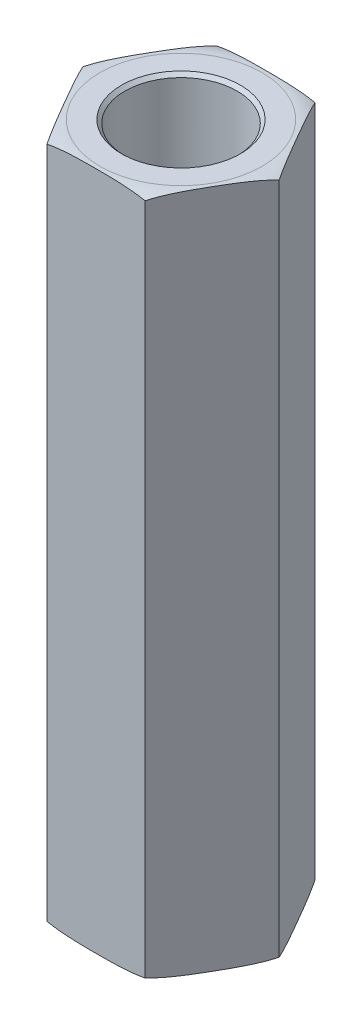
ISO-10303-21;
HEADER;
FILE_DESCRIPTION(('STEP AP214'),'2;1');
FILE_NAME('part.step','',(''),(''),'','','');
FILE_SCHEMA(('AUTOMOTIVE_DESIGN { 1 0 10303 214 1 1 1 1 }'));
ENDSEC;
DATA;
#1=APPLICATION_CONTEXT('core data for automotive mechanical design processes');
#2=APPLICATION_PROTOCOL_DEFINITION('international standard','automotive_design',2000,#1);
#3=PRODUCT_CONTEXT('',#1,'mechanical');
#4=PRODUCT('Part','Part','',(#3));
#5=PRODUCT_RELATED_PRODUCT_CATEGORY('part','',(#4));
#6=PRODUCT_DEFINITION_FORMATION('','',#4);
#7=PRODUCT_DEFINITION_CONTEXT('part definition',#1,'design');
#8=PRODUCT_DEFINITION('design','',#6,#7);
#9=PRODUCT_DEFINITION_SHAPE('','',#8);
#10=(LENGTH_UNIT() NAMED_UNIT(*) SI_UNIT(.MILLI.,.METRE.));
#11=(NAMED_UNIT(*) PLANE_ANGLE_UNIT() SI_UNIT($,.RADIAN.));
#12=(NAMED_UNIT(*) SI_UNIT($,.STERADIAN.) SOLID_ANGLE_UNIT());
#13=UNCERTAINTY_MEASURE_WITH_UNIT(LENGTH_MEASURE(1.E-05),#10,'distance_accuracy_value','');
#14=(GEOMETRIC_REPRESENTATION_CONTEXT(3) GLOBAL_UNCERTAINTY_ASSIGNED_CONTEXT((#13)) GLOBAL_UNIT_ASSIGNED_CONTEXT((#10,
#11,#12)) REPRESENTATION_CONTEXT('',''));
#15=CARTESIAN_POINT('',(0.,0.,0.));
#16=DIRECTION('',(0.,0.,1.));
#17=DIRECTION('',(1.,0.,0.));
#18=AXIS2_PLACEMENT_3D('',#15,#16,#17);
#19=CARTESIAN_POINT('',(3.66617420935412,12.7,0.));
#20=DIRECTION('',(-0.866025403784439,0.,0.5));
#21=DIRECTION('',(0.5,0.,0.866025403784439));
#22=AXIS2_PLACEMENT_3D('',#19,#20,#21);
#23=PLANE('',#22);
#24=DIRECTION('',(0.,1.,0.));
#25=VECTOR('',#24,1.);
#26=CARTESIAN_POINT('',(1.83308710467704,12.7,-3.175));
#27=LINE('',#26,#25);
#28=CARTESIAN_POINT('',(1.83308710467705,-12.573,-3.175));
#29=VERTEX_POINT('',#28);
#30=CARTESIAN_POINT('',(1.83308710467706,12.573,-3.175));
#31=VERTEX_POINT('',#30);
#32=EDGE_CURVE('E142',#29,#31,#27,.T.);
#33=ORIENTED_EDGE('',*,*,#32,.T.);
#34=CARTESIAN_POINT('',(3.66617420935412,12.573,0.));
#35=CARTESIAN_POINT('',(3.62797961467394,12.5889014148997,-0.0661549785605585));
#36=CARTESIAN_POINT('',(3.58956810864157,12.6024886076105,-0.132685658603878));
#37=CARTESIAN_POINT('',(3.5124905179571,12.6258161979402,-0.266187961794366));
#38=CARTESIAN_POINT('',(3.47382473049846,12.6355604771397,-0.333159070187399));
#39=CARTESIAN_POINT('',(3.39641631867872,12.6519966530451,-0.467234372392395));
#40=CARTESIAN_POINT('',(3.35767399633311,12.6586945328669,-0.534338043098201));
#41=CARTESIAN_POINT('',(3.28009834620112,12.6697767572932,-0.668703010557003));
#42=CARTESIAN_POINT('',(3.2412649958777,12.674160450474,-0.735964346345292));
#43=CARTESIAN_POINT('',(3.16354065964313,12.6812403004263,-0.870586845688127));
#44=CARTESIAN_POINT('',(3.12464965374474,12.6839355237591,-0.9379480438616));
#45=CARTESIAN_POINT('',(3.04685144594591,12.6881531983713,-1.07269849250698));
#46=CARTESIAN_POINT('',(3.00794424351967,12.6896756080272,-1.14008774388959));
#47=CARTESIAN_POINT('',(2.93051517598871,12.691922705889,-1.2741988228359));
#48=CARTESIAN_POINT('',(2.89199336248932,12.6926552468181,-1.34092056101654));
#49=CARTESIAN_POINT('',(2.8149477834614,12.6935767302574,-1.47436741839144));
#50=CARTESIAN_POINT('',(2.77642401791436,12.6937656658949,-1.5410925376178));
#51=CARTESIAN_POINT('',(2.69935964431009,12.6936659966806,-1.67457194815386));
#52=CARTESIAN_POINT('',(2.66081903631818,12.6933771811766,-1.74132623935045));
#53=CARTESIAN_POINT('',(2.58373908085326,12.692221986219,-1.87483263846084));
#54=CARTESIAN_POINT('',(2.54519973341241,12.6913555970386,-1.94158474631893));
#55=CARTESIAN_POINT('',(2.46812969629766,12.6887861940656,-2.0750739663429));
#56=CARTESIAN_POINT('',(2.42959900625961,12.6870832271617,-2.1418110791395));
#57=CARTESIAN_POINT('',(2.35255651340904,12.6824387229726,-2.27525259109845));
#58=CARTESIAN_POINT('',(2.31404470975438,12.6794972471358,-2.34195699171943));
#59=CARTESIAN_POINT('',(2.2508420623994,12.6732174124749,-2.45142718811111));
#60=CARTESIAN_POINT('',(2.22613849337005,12.6703980110463,-2.49421502479823));
#61=CARTESIAN_POINT('',(2.17676945272224,12.6638696794304,-2.57972471152118));
#62=CARTESIAN_POINT('',(2.1521039703418,12.6601610809139,-2.6224465801973));
#63=CARTESIAN_POINT('',(2.10282753811693,12.6516802711497,-2.7077958644265));
#64=CARTESIAN_POINT('',(2.07821657107526,12.6469084657008,-2.75042330976607));
#65=CARTESIAN_POINT('',(2.02900094683547,12.6360987712516,-2.8356672714756));
#66=CARTESIAN_POINT('',(2.00439646085461,12.6300577313084,-2.87828349128856));
#67=CARTESIAN_POINT('',(1.95527325900932,12.6165138354161,-2.96336737271507));
#68=CARTESIAN_POINT('',(1.93075459617613,12.609010197803,-3.00583494247581));
#69=CARTESIAN_POINT('',(1.8818215737317,12.5923203507084,-3.09058942351746));
#70=CARTESIAN_POINT('',(1.85740744053269,12.5831314978033,-3.13287594264091));
#71=CARTESIAN_POINT('',(1.83308710467706,12.573,-3.175));
#72=B_SPLINE_CURVE_WITH_KNOTS('',3,(#34,#35,#36,#37,#38,#39,#40,#41,#42,#43,#44,#45,#46,#47,#48,
#49,#50,#51,#52,#53,#54,#55,#56,#57,#58,#59,#60,#61,#62,#63,#64,#65,#66,#67,#68,#69,#70,#71),
.UNSPECIFIED.,.F.,.F.,(4,2,2,2,2,2,2,2,2,2,2,2,2,2,2,2,2,2,4),(0.,0.233977307817949,
0.467717675040708,0.700996973557522,0.934341903229779,1.16781571967243,1.40129782179829,
1.63243665809675,1.86357841666623,2.09482211846301,2.32606971471502,2.55730435147406,
2.78852751694422,2.93698369265095,3.0853845800448,3.23372892334589,3.38244598546616,
3.53124274626086,3.68027493713586),.UNSPECIFIED.);
#73=CARTESIAN_POINT('',(3.66617420935412,12.573,0.));
#74=VERTEX_POINT('',#73);
#75=EDGE_CURVE('E96',#74,#31,#72,.T.);
#76=ORIENTED_EDGE('',*,*,#75,.F.);
#77=DIRECTION('',(0.,1.,0.));
#78=VECTOR('',#77,1.);
#79=CARTESIAN_POINT('',(3.66617420935412,12.7,0.));
#80=LINE('',#79,#78);
#81=CARTESIAN_POINT('',(3.66617420935412,-12.573,0.));
#82=VERTEX_POINT('',#81);
#83=EDGE_CURVE('E144',#74,#82,#80,.F.);
#84=ORIENTED_EDGE('',*,*,#83,.T.);
#85=CARTESIAN_POINT('',(1.83308710467705,-12.573,-3.17500000000001));
#86=CARTESIAN_POINT('',(1.87128169935723,-12.5889014148997,-3.10884502143945));
#87=CARTESIAN_POINT('',(1.9096932053896,-12.6024886076105,-3.04231434139613));
#88=CARTESIAN_POINT('',(1.98677079607407,-12.6258161979402,-2.90881203820565));
#89=CARTESIAN_POINT('',(2.02543658353271,-12.6355604771397,-2.84184092981261));
#90=CARTESIAN_POINT('',(2.10284499535244,-12.6519966530451,-2.70776562760762));
#91=CARTESIAN_POINT('',(2.14158731769805,-12.6586945328669,-2.64066195690182));
#92=CARTESIAN_POINT('',(2.21916296783004,-12.6697767572932,-2.50629698944302));
#93=CARTESIAN_POINT('',(2.25799631815347,-12.674160450474,-2.43903565365473));
#94=CARTESIAN_POINT('',(2.33572065438803,-12.6812403004263,-2.3044131543119));
#95=CARTESIAN_POINT('',(2.37461166028642,-12.6839355237591,-2.23705195613842));
#96=CARTESIAN_POINT('',(2.45240986808525,-12.6881531983713,-2.10230150749305));
#97=CARTESIAN_POINT('',(2.49131707051149,-12.6896756080272,-2.03491225611044));
#98=CARTESIAN_POINT('',(2.56874613804245,-12.691922705889,-1.90080117716413));
#99=CARTESIAN_POINT('',(2.60726795154184,-12.6926552468181,-1.8340794389835));
#100=CARTESIAN_POINT('',(2.68431353056975,-12.6935767302574,-1.70063258160859));
#101=CARTESIAN_POINT('',(2.72283729611679,-12.6937656658949,-1.63390746238224));
#102=CARTESIAN_POINT('',(2.79990166972106,-12.6936659966806,-1.50042805184618));
#103=CARTESIAN_POINT('',(2.83844227771297,-12.6933771811766,-1.43367376064959));
#104=CARTESIAN_POINT('',(2.91552223317789,-12.692221986219,-1.30016736153921));
#105=CARTESIAN_POINT('',(2.95406158061874,-12.6913555970386,-1.23341525368111));
#106=CARTESIAN_POINT('',(3.03113161773348,-12.6887861940656,-1.09992603365715));
#107=CARTESIAN_POINT('',(3.06966230777154,-12.6870832271617,-1.03318892086055));
#108=CARTESIAN_POINT('',(3.14670480062211,-12.6824387229726,-0.899747408901607));
#109=CARTESIAN_POINT('',(3.18521660427677,-12.6794972471358,-0.833043008280621));
#110=CARTESIAN_POINT('',(3.24841925163175,-12.6732174124749,-0.723572811888938));
#111=CARTESIAN_POINT('',(3.27312282066109,-12.6703980110463,-0.680784975201824));
#112=CARTESIAN_POINT('',(3.32249186130891,-12.6638696794304,-0.595275288478867));
#113=CARTESIAN_POINT('',(3.34715734368935,-12.6601610809139,-0.552553419802744));
#114=CARTESIAN_POINT('',(3.39643377591423,-12.6516802711497,-0.467204135573539));
#115=CARTESIAN_POINT('',(3.4210447429559,-12.6469084657008,-0.424576690233965));
#116=CARTESIAN_POINT('',(3.47026036719569,-12.6360987712516,-0.339332728524428));
#117=CARTESIAN_POINT('',(3.49486485317655,-12.6300577313084,-0.296716508711459));
#118=CARTESIAN_POINT('',(3.54398805502185,-12.6165138354161,-0.211632627284942));
#119=CARTESIAN_POINT('',(3.56850671785504,-12.609010197803,-0.169165057524202));
#120=CARTESIAN_POINT('',(3.61743974029947,-12.5923203507084,-0.0844105764825456));
#121=CARTESIAN_POINT('',(3.64185387349848,-12.5831314978033,-0.0421240573590982));
#122=CARTESIAN_POINT('',(3.66617420935412,-12.573,0.));
#123=B_SPLINE_CURVE_WITH_KNOTS('',3,(#85,#86,#87,#88,#89,#90,#91,#92,#93,#94,#95,#96,#97,#98,
#99,#100,#101,#102,#103,#104,#105,#106,#107,#108,#109,#110,#111,#112,#113,#114,#115,#116,#117,
#118,#119,#120,#121,#122),.UNSPECIFIED.,.F.,.F.,(4,2,2,2,2,2,2,2,2,2,2,2,2,2,2,2,2,2,4),(0.,
0.233977307817944,0.467717675040699,0.700996973557508,0.934341903229761,1.16781571967241,
1.40129782179826,1.63243665809671,1.86357841666619,2.09482211846297,2.32606971471497,
2.55730435147401,2.78852751694416,2.9369836926509,3.08538458004476,3.23372892334587,
3.38244598546614,3.53124274626085,3.68027493713586),.UNSPECIFIED.);
#124=EDGE_CURVE('E220',#29,#82,#123,.T.);
#125=ORIENTED_EDGE('',*,*,#124,.F.);
#126=EDGE_LOOP('',(#33,#76,#84,#125));
#127=FACE_BOUND('',#126,.T.);
#128=ADVANCED_FACE('F16',(#127),#23,.F.);
#129=CARTESIAN_POINT('',(1.83308710467706,12.7,3.17499999999999));
#130=DIRECTION('',(-0.866025403784439,0.,-0.5));
#131=DIRECTION('',(-0.5,0.,0.866025403784439));
#132=AXIS2_PLACEMENT_3D('',#129,#130,#131);
#133=PLANE('',#132);
#134=ORIENTED_EDGE('',*,*,#83,.F.);
#135=CARTESIAN_POINT('',(1.83308710467706,12.573,3.17499999999999));
#136=CARTESIAN_POINT('',(1.87128169935724,12.5889014148997,3.10884502143943));
#137=CARTESIAN_POINT('',(1.90969320538962,12.6024886076105,3.04231434139611));
#138=CARTESIAN_POINT('',(1.98677079607408,12.6258161979402,2.90881203820562));
#139=CARTESIAN_POINT('',(2.02543658353273,12.6355604771397,2.84184092981259));
#140=CARTESIAN_POINT('',(2.10284499535246,12.6519966530451,2.7077656276076));
#141=CARTESIAN_POINT('',(2.14158731769807,12.6586945328669,2.64066195690179));
#142=CARTESIAN_POINT('',(2.21916296783006,12.6697767572932,2.50629698944299));
#143=CARTESIAN_POINT('',(2.25799631815349,12.674160450474,2.4390356536547));
#144=CARTESIAN_POINT('',(2.33572065438805,12.6812403004263,2.30441315431186));
#145=CARTESIAN_POINT('',(2.37461166028644,12.6839355237591,2.23705195613839));
#146=CARTESIAN_POINT('',(2.45240986808528,12.6881531983713,2.10230150749301));
#147=CARTESIAN_POINT('',(2.49131707051151,12.6896756080272,2.0349122561104));
#148=CARTESIAN_POINT('',(2.56874613804248,12.691922705889,1.90080117716409));
#149=CARTESIAN_POINT('',(2.60726795154187,12.6926552468181,1.83407943898345));
#150=CARTESIAN_POINT('',(2.68431353056978,12.6935767302574,1.70063258160855));
#151=CARTESIAN_POINT('',(2.72283729611682,12.6937656658949,1.63390746238219));
#152=CARTESIAN_POINT('',(2.79990166972109,12.6936659966806,1.50042805184613));
#153=CARTESIAN_POINT('',(2.83844227771301,12.6933771811766,1.43367376064954));
#154=CARTESIAN_POINT('',(2.91552223317792,12.692221986219,1.30016736153915));
#155=CARTESIAN_POINT('',(2.95406158061877,12.6913555970386,1.23341525368106));
#156=CARTESIAN_POINT('',(3.03113161773352,12.6887861940656,1.09992603365709));
#157=CARTESIAN_POINT('',(3.06966230777158,12.6870832271617,1.03318892086049));
#158=CARTESIAN_POINT('',(3.14670480062214,12.6824387229726,0.899747408901544));
#159=CARTESIAN_POINT('',(3.1852166042768,12.6794972471358,0.833043008280556));
#160=CARTESIAN_POINT('',(3.24841925163178,12.6732174124749,0.723572811888876));
#161=CARTESIAN_POINT('',(3.27312282066113,12.6703980110463,0.680784975201767));
#162=CARTESIAN_POINT('',(3.32249186130894,12.6638696794304,0.595275288478818));
#163=CARTESIAN_POINT('',(3.34715734368938,12.6601610809139,0.552553419802699));
#164=CARTESIAN_POINT('',(3.39643377591425,12.6516802711497,0.467204135573501));
#165=CARTESIAN_POINT('',(3.42104474295592,12.6469084657008,0.424576690233932));
#166=CARTESIAN_POINT('',(3.47026036719571,12.6360987712516,0.339332728524402));
#167=CARTESIAN_POINT('',(3.49486485317657,12.6300577313084,0.296716508711437));
#168=CARTESIAN_POINT('',(3.54398805502186,12.6165138354161,0.211632627284927));
#169=CARTESIAN_POINT('',(3.56850671785505,12.609010197803,0.169165057524192));
#170=CARTESIAN_POINT('',(3.61743974029947,12.5923203507084,0.0844105764825436));
#171=CARTESIAN_POINT('',(3.64185387349848,12.5831314978033,0.0421240573591002));
#172=CARTESIAN_POINT('',(3.66617420935412,12.573,0.));
#173=B_SPLINE_CURVE_WITH_KNOTS('',3,(#135,#136,#137,#138,#139,#140,#141,#142,#143,#144,#145,
#146,#147,#148,#149,#150,#151,#152,#153,#154,#155,#156,#157,#158,#159,#160,#161,#162,#163,#164,
#165,#166,#167,#168,#169,#170,#171,#172),.UNSPECIFIED.,.F.,.F.,(4,2,2,2,2,2,2,2,2,2,2,2,2,2,2,2,
2,2,4),(0.,0.23397730781795,0.467717675040709,0.700996973557522,0.93434190322978,
1.16781571967243,1.40129782179829,1.63243665809675,1.86357841666623,2.09482211846301,
2.32606971471502,2.55730435147406,2.78852751694422,2.93698369265095,3.08538458004479,
3.23372892334589,3.38244598546615,3.53124274626085,3.68027493713584),.UNSPECIFIED.);
#174=CARTESIAN_POINT('',(1.83308710467706,12.573,3.17499999999999));
#175=VERTEX_POINT('',#174);
#176=EDGE_CURVE('E213',#175,#74,#173,.T.);
#177=ORIENTED_EDGE('',*,*,#176,.F.);
#178=DIRECTION('',(0.,1.,0.));
#179=VECTOR('',#178,1.);
#180=CARTESIAN_POINT('',(1.83308710467706,12.7,3.17499999999999));
#181=LINE('',#180,#179);
#182=CARTESIAN_POINT('',(1.83308710467706,-12.573,3.17499999999999));
#183=VERTEX_POINT('',#182);
#184=EDGE_CURVE('E139',#175,#183,#181,.F.);
#185=ORIENTED_EDGE('',*,*,#184,.T.);
#186=CARTESIAN_POINT('',(3.66617420935412,-12.573,0.));
#187=CARTESIAN_POINT('',(3.62797961467394,-12.5889014148997,0.0661549785605638));
#188=CARTESIAN_POINT('',(3.58956810864156,-12.6024886076105,0.132685658603883));
#189=CARTESIAN_POINT('',(3.5124905179571,-12.6258161979402,0.266187961794371));
#190=CARTESIAN_POINT('',(3.47382473049846,-12.6355604771397,0.333159070187405));
#191=CARTESIAN_POINT('',(3.39641631867872,-12.6519966530451,0.467234372392401));
#192=CARTESIAN_POINT('',(3.35767399633311,-12.6586945328669,0.534338043098206));
#193=CARTESIAN_POINT('',(3.28009834620112,-12.6697767572932,0.668703010557008));
#194=CARTESIAN_POINT('',(3.2412649958777,-12.674160450474,0.735964346345298));
#195=CARTESIAN_POINT('',(3.16354065964313,-12.6812403004263,0.870586845688132));
#196=CARTESIAN_POINT('',(3.12464965374474,-12.6839355237591,0.937948043861606));
#197=CARTESIAN_POINT('',(3.0468514459459,-12.6881531983713,1.07269849250699));
#198=CARTESIAN_POINT('',(3.00794424351967,-12.6896756080272,1.1400877438896));
#199=CARTESIAN_POINT('',(2.9305151759887,-12.691922705889,1.27419882283591));
#200=CARTESIAN_POINT('',(2.89199336248931,-12.6926552468181,1.34092056101654));
#201=CARTESIAN_POINT('',(2.8149477834614,-12.6935767302574,1.47436741839145));
#202=CARTESIAN_POINT('',(2.77642401791436,-12.6937656658949,1.5410925376178));
#203=CARTESIAN_POINT('',(2.69935964431009,-12.6936659966806,1.67457194815387));
#204=CARTESIAN_POINT('',(2.66081903631818,-12.6933771811766,1.74132623935046));
#205=CARTESIAN_POINT('',(2.58373908085326,-12.692221986219,1.87483263846084));
#206=CARTESIAN_POINT('',(2.54519973341241,-12.6913555970386,1.94158474631894));
#207=CARTESIAN_POINT('',(2.46812969629766,-12.6887861940656,2.0750739663429));
#208=CARTESIAN_POINT('',(2.4295990062596,-12.6870832271616,2.14181107913951));
#209=CARTESIAN_POINT('',(2.35255651340904,-12.6824387229726,2.27525259109845));
#210=CARTESIAN_POINT('',(2.31404470975437,-12.6794972471358,2.34195699171944));
#211=CARTESIAN_POINT('',(2.2508420623994,-12.6732174124749,2.45142718811112));
#212=CARTESIAN_POINT('',(2.22613849337005,-12.6703980110463,2.49421502479823));
#213=CARTESIAN_POINT('',(2.17676945272224,-12.6638696794304,2.57972471152118));
#214=CARTESIAN_POINT('',(2.1521039703418,-12.6601610809139,2.6224465801973));
#215=CARTESIAN_POINT('',(2.10282753811693,-12.6516802711497,2.7077958644265));
#216=CARTESIAN_POINT('',(2.07821657107526,-12.6469084657008,2.75042330976606));
#217=CARTESIAN_POINT('',(2.02900094683548,-12.6360987712516,2.83566727147559));
#218=CARTESIAN_POINT('',(2.00439646085462,-12.6300577313084,2.87828349128856));
#219=CARTESIAN_POINT('',(1.95527325900932,-12.6165138354161,2.96336737271507));
#220=CARTESIAN_POINT('',(1.93075459617613,-12.609010197803,3.0058349424758));
#221=CARTESIAN_POINT('',(1.88182157373171,-12.5923203507084,3.09058942351745));
#222=CARTESIAN_POINT('',(1.8574074405327,-12.5831314978033,3.1328759426409));
#223=CARTESIAN_POINT('',(1.83308710467706,-12.573,3.17499999999999));
#224=B_SPLINE_CURVE_WITH_KNOTS('',3,(#186,#187,#188,#189,#190,#191,#192,#193,#194,#195,#196,
#197,#198,#199,#200,#201,#202,#203,#204,#205,#206,#207,#208,#209,#210,#211,#212,#213,#214,#215,
#216,#217,#218,#219,#220,#221,#222,#223),.UNSPECIFIED.,.F.,.F.,(4,2,2,2,2,2,2,2,2,2,2,2,2,2,2,2,
2,2,4),(0.,0.233977307817949,0.467717675040709,0.700996973557522,0.93434190322978,
1.16781571967243,1.40129782179829,1.63243665809675,1.86357841666623,2.09482211846301,
2.32606971471502,2.55730435147406,2.78852751694422,2.93698369265095,3.08538458004479,
3.23372892334589,3.38244598546615,3.53124274626085,3.68027493713584),.UNSPECIFIED.);
#225=EDGE_CURVE('E239',#82,#183,#224,.T.);
#226=ORIENTED_EDGE('',*,*,#225,.F.);
#227=EDGE_LOOP('',(#134,#177,#185,#226));
#228=FACE_BOUND('',#227,.T.);
#229=ADVANCED_FACE('F217',(#228),#133,.F.);
#230=CARTESIAN_POINT('',(1.83308710467706,12.7,-3.175));
#231=DIRECTION('',(0.,0.,1.));
#232=DIRECTION('',(1.,0.,0.));
#233=AXIS2_PLACEMENT_3D('',#230,#231,#232);
#234=PLANE('',#233);
#235=DIRECTION('',(0.,1.,0.));
#236=VECTOR('',#235,1.);
#237=CARTESIAN_POINT('',(-1.83308710467707,12.7,-3.175));
#238=LINE('',#237,#236);
#239=CARTESIAN_POINT('',(-1.83308710467707,-12.573,-3.175));
#240=VERTEX_POINT('',#239);
#241=CARTESIAN_POINT('',(-1.83308710467706,12.573,-3.17500000000001));
#242=VERTEX_POINT('',#241);
#243=EDGE_CURVE('E103',#240,#242,#238,.T.);
#244=ORIENTED_EDGE('',*,*,#243,.T.);
#245=CARTESIAN_POINT('',(1.83308710467706,12.573,-3.175));
#246=CARTESIAN_POINT('',(1.73237579828683,12.5939400141518,-3.175));
#247=CARTESIAN_POINT('',(1.63096506893486,12.6108853495327,-3.175));
#248=CARTESIAN_POINT('',(1.42767146651469,12.6384971643984,-3.175));
#249=CARTESIAN_POINT('',(1.32579191427254,12.6491875658753,-3.175));
#250=CARTESIAN_POINT('',(1.12177634709137,12.6661280408079,-3.175));
#251=CARTESIAN_POINT('',(1.0196405664338,12.6723812707189,-3.175));
#252=CARTESIAN_POINT('',(0.815663681397375,12.6819028064183,-3.175));
#253=CARTESIAN_POINT('',(0.713823115514573,12.6851834044999,-3.175));
#254=CARTESIAN_POINT('',(0.510018485441651,12.6899454848703,-3.175));
#255=CARTESIAN_POINT('',(0.408054390577976,12.6914254100882,-3.175));
#256=CARTESIAN_POINT('',(0.20406020033787,12.6933146818379,-3.175));
#257=CARTESIAN_POINT('',(0.102030100168935,12.6937234241492,-3.175));
#258=CARTESIAN_POINT('',(-0.102030100168934,12.6937234241492,-3.175));
#259=CARTESIAN_POINT('',(-0.204060200337869,12.6933146818379,-3.175));
#260=CARTESIAN_POINT('',(-0.408054390577974,12.6914254100882,-3.175));
#261=CARTESIAN_POINT('',(-0.510018485441649,12.6899454848703,-3.175));
#262=CARTESIAN_POINT('',(-0.71382311551457,12.6851834044999,-3.175));
#263=CARTESIAN_POINT('',(-0.815663681397372,12.6819028064183,-3.175));
#264=CARTESIAN_POINT('',(-1.01964056643379,12.6723812707189,-3.175));
#265=CARTESIAN_POINT('',(-1.12177634709137,12.6661280408079,-3.175));
#266=CARTESIAN_POINT('',(-1.32579191427253,12.6491875658753,-3.175));
#267=CARTESIAN_POINT('',(-1.42767146651468,12.6384971643984,-3.175));
#268=CARTESIAN_POINT('',(-1.63096506893485,12.6108853495327,-3.175));
#269=CARTESIAN_POINT('',(-1.73237579828682,12.5939400141518,-3.175));
#270=CARTESIAN_POINT('',(-1.83308710467705,12.573,-3.175));
#271=B_SPLINE_CURVE_WITH_KNOTS('',3,(#245,#246,#247,#248,#249,#250,#251,#252,#253,#254,#255,
#256,#257,#258,#259,#260,#261,#262,#263,#264,#265,#266,#267,#268,#269,#270),.UNSPECIFIED.,.F.,
.F.,(4,2,2,2,2,2,2,2,2,2,2,2,4),(0.,0.308333242342807,0.615479423308234,0.922406891130008,
1.2280592962085,1.53397581645216,1.84006485747889,2.14615389850561,2.45207041874927,
2.75772282382776,3.06465029164953,3.37179647261496,3.68012971495777),.UNSPECIFIED.);
#272=EDGE_CURVE('E88',#31,#242,#271,.T.);
#273=ORIENTED_EDGE('',*,*,#272,.F.);
#274=ORIENTED_EDGE('',*,*,#32,.F.);
#275=CARTESIAN_POINT('',(-1.83308710467707,-12.573,-3.175));
#276=CARTESIAN_POINT('',(-1.73237579828684,-12.5939400141518,-3.175));
#277=CARTESIAN_POINT('',(-1.63096506893487,-12.6108853495327,-3.175));
#278=CARTESIAN_POINT('',(-1.4276714665147,-12.6384971643984,-3.175));
#279=CARTESIAN_POINT('',(-1.32579191427255,-12.6491875658753,-3.175));
#280=CARTESIAN_POINT('',(-1.12177634709138,-12.6661280408079,-3.175));
#281=CARTESIAN_POINT('',(-1.0196405664338,-12.6723812707189,-3.175));
#282=CARTESIAN_POINT('',(-0.81566368139738,-12.6819028064183,-3.175));
#283=CARTESIAN_POINT('',(-0.713823115514577,-12.6851834044999,-3.175));
#284=CARTESIAN_POINT('',(-0.510018485441653,-12.6899454848703,-3.175));
#285=CARTESIAN_POINT('',(-0.408054390577979,-12.6914254100882,-3.175));
#286=CARTESIAN_POINT('',(-0.204060200337872,-12.6933146818379,-3.175));
#287=CARTESIAN_POINT('',(-0.102030100168936,-12.6937234241492,-3.175));
#288=CARTESIAN_POINT('',(0.102030100168934,-12.6937234241492,-3.175));
#289=CARTESIAN_POINT('',(0.204060200337868,-12.6933146818379,-3.175));
#290=CARTESIAN_POINT('',(0.408054390577973,-12.6914254100882,-3.175));
#291=CARTESIAN_POINT('',(0.510018485441647,-12.6899454848703,-3.175));
#292=CARTESIAN_POINT('',(0.713823115514568,-12.6851834044999,-3.175));
#293=CARTESIAN_POINT('',(0.81566368139737,-12.6819028064183,-3.175));
#294=CARTESIAN_POINT('',(1.01964056643379,-12.6723812707189,-3.175));
#295=CARTESIAN_POINT('',(1.12177634709137,-12.6661280408079,-3.175));
#296=CARTESIAN_POINT('',(1.32579191427253,-12.6491875658753,-3.175));
#297=CARTESIAN_POINT('',(1.42767146651468,-12.6384971643984,-3.175));
#298=CARTESIAN_POINT('',(1.63096506893485,-12.6108853495327,-3.175));
#299=CARTESIAN_POINT('',(1.73237579828682,-12.5939400141518,-3.175));
#300=CARTESIAN_POINT('',(1.83308710467705,-12.573,-3.175));
#301=B_SPLINE_CURVE_WITH_KNOTS('',3,(#275,#276,#277,#278,#279,#280,#281,#282,#283,#284,#285,
#286,#287,#288,#289,#290,#291,#292,#293,#294,#295,#296,#297,#298,#299,#300),.UNSPECIFIED.,.F.,
.F.,(4,2,2,2,2,2,2,2,2,2,2,2,4),(0.,0.308333242342808,0.615479423308238,0.922406891130013,
1.22805929620851,1.53397581645217,1.8400648574789,2.14615389850562,2.45207041874928,
2.75772282382777,3.06465029164954,3.37179647261497,3.68012971495777),.UNSPECIFIED.);
#302=EDGE_CURVE('E105',#240,#29,#301,.T.);
#303=ORIENTED_EDGE('',*,*,#302,.F.);
#304=EDGE_LOOP('',(#244,#273,#274,#303));
#305=FACE_BOUND('',#304,.T.);
#306=ADVANCED_FACE('F104',(#305),#234,.F.);
#307=CARTESIAN_POINT('',(-1.83308710467707,12.7,3.175));
#308=DIRECTION('',(0.,0.,-1.));
#309=DIRECTION('',(-1.,0.,0.));
#310=AXIS2_PLACEMENT_3D('',#307,#308,#309);
#311=PLANE('',#310);
#312=ORIENTED_EDGE('',*,*,#184,.F.);
#313=CARTESIAN_POINT('',(-1.83308710467706,12.573,3.175));
#314=CARTESIAN_POINT('',(-1.73237579828684,12.5939400141518,3.175));
#315=CARTESIAN_POINT('',(-1.63096506893486,12.6108853495327,3.175));
#316=CARTESIAN_POINT('',(-1.42767146651469,12.6384971643984,3.175));
#317=CARTESIAN_POINT('',(-1.32579191427254,12.6491875658753,3.175));
#318=CARTESIAN_POINT('',(-1.12177634709138,12.6661280408079,3.175));
#319=CARTESIAN_POINT('',(-1.0196405664338,12.6723812707189,3.175));
#320=CARTESIAN_POINT('',(-0.815663681397378,12.6819028064183,3.175));
#321=CARTESIAN_POINT('',(-0.713823115514575,12.6851834044999,3.175));
#322=CARTESIAN_POINT('',(-0.510018485441652,12.6899454848703,3.175));
#323=CARTESIAN_POINT('',(-0.408054390577977,12.6914254100882,3.175));
#324=CARTESIAN_POINT('',(-0.204060200337871,12.6933146818379,3.175));
#325=CARTESIAN_POINT('',(-0.102030100168935,12.6937234241492,3.17499999999999));
#326=CARTESIAN_POINT('',(0.102030100168935,12.6937234241492,3.17499999999999));
#327=CARTESIAN_POINT('',(0.204060200337871,12.6933146818379,3.17499999999999));
#328=CARTESIAN_POINT('',(0.408054390577978,12.6914254100882,3.17499999999999));
#329=CARTESIAN_POINT('',(0.510018485441652,12.6899454848703,3.17499999999999));
#330=CARTESIAN_POINT('',(0.713823115514575,12.6851834044999,3.17499999999999));
#331=CARTESIAN_POINT('',(0.815663681397378,12.6819028064183,3.17499999999999));
#332=CARTESIAN_POINT('',(1.0196405664338,12.6723812707189,3.17499999999999));
#333=CARTESIAN_POINT('',(1.12177634709138,12.6661280408079,3.17499999999999));
#334=CARTESIAN_POINT('',(1.32579191427254,12.6491875658753,3.17499999999999));
#335=CARTESIAN_POINT('',(1.42767146651469,12.6384971643984,3.17499999999999));
#336=CARTESIAN_POINT('',(1.63096506893486,12.6108853495327,3.17499999999999));
#337=CARTESIAN_POINT('',(1.73237579828684,12.5939400141518,3.17499999999999));
#338=CARTESIAN_POINT('',(1.83308710467706,12.573,3.17499999999999));
#339=B_SPLINE_CURVE_WITH_KNOTS('',3,(#313,#314,#315,#316,#317,#318,#319,#320,#321,#322,#323,
#324,#325,#326,#327,#328,#329,#330,#331,#332,#333,#334,#335,#336,#337,#338),.UNSPECIFIED.,.F.,
.F.,(4,2,2,2,2,2,2,2,2,2,2,2,4),(0.,0.308333242342808,0.615479423308237,0.922406891130011,
1.2280592962085,1.53397581645216,1.84006485747889,2.14615389850562,2.45207041874928,
2.75772282382777,3.06465029164955,3.37179647261498,3.68012971495779),.UNSPECIFIED.);
#340=CARTESIAN_POINT('',(-1.83308710467707,12.573,3.175));
#341=VERTEX_POINT('',#340);
#342=EDGE_CURVE('E99',#341,#175,#339,.T.);
#343=ORIENTED_EDGE('',*,*,#342,.F.);
#344=DIRECTION('',(0.,1.,0.));
#345=VECTOR('',#344,1.);
#346=CARTESIAN_POINT('',(-1.83308710467707,12.7,3.175));
#347=LINE('',#346,#345);
#348=CARTESIAN_POINT('',(-1.83308710467706,-12.573,3.175));
#349=VERTEX_POINT('',#348);
#350=EDGE_CURVE('E107',#341,#349,#347,.F.);
#351=ORIENTED_EDGE('',*,*,#350,.T.);
#352=CARTESIAN_POINT('',(1.83308710467706,-12.573,3.17499999999999));
#353=CARTESIAN_POINT('',(1.73237579828684,-12.5939400141518,3.17499999999999));
#354=CARTESIAN_POINT('',(1.63096506893486,-12.6108853495327,3.17499999999999));
#355=CARTESIAN_POINT('',(1.4276714665147,-12.6384971643984,3.17499999999999));
#356=CARTESIAN_POINT('',(1.32579191427254,-12.6491875658753,3.17499999999999));
#357=CARTESIAN_POINT('',(1.12177634709138,-12.6661280408079,3.17499999999999));
#358=CARTESIAN_POINT('',(1.0196405664338,-12.6723812707189,3.17499999999999));
#359=CARTESIAN_POINT('',(0.815663681397379,-12.6819028064183,3.17499999999999));
#360=CARTESIAN_POINT('',(0.713823115514576,-12.6851834044999,3.17499999999999));
#361=CARTESIAN_POINT('',(0.510018485441653,-12.6899454848703,3.17499999999999));
#362=CARTESIAN_POINT('',(0.408054390577978,-12.6914254100882,3.17499999999999));
#363=CARTESIAN_POINT('',(0.204060200337871,-12.6933146818379,3.17499999999999));
#364=CARTESIAN_POINT('',(0.102030100168935,-12.6937234241492,3.17499999999999));
#365=CARTESIAN_POINT('',(-0.102030100168935,-12.6937234241492,3.17499999999999));
#366=CARTESIAN_POINT('',(-0.204060200337871,-12.6933146818379,3.175));
#367=CARTESIAN_POINT('',(-0.408054390577977,-12.6914254100882,3.175));
#368=CARTESIAN_POINT('',(-0.510018485441652,-12.6899454848703,3.175));
#369=CARTESIAN_POINT('',(-0.713823115514575,-12.6851834044999,3.175));
#370=CARTESIAN_POINT('',(-0.815663681397377,-12.6819028064183,3.175));
#371=CARTESIAN_POINT('',(-1.0196405664338,-12.6723812707189,3.175));
#372=CARTESIAN_POINT('',(-1.12177634709138,-12.6661280408079,3.175));
#373=CARTESIAN_POINT('',(-1.32579191427254,-12.6491875658753,3.175));
#374=CARTESIAN_POINT('',(-1.42767146651469,-12.6384971643984,3.175));
#375=CARTESIAN_POINT('',(-1.63096506893486,-12.6108853495327,3.175));
#376=CARTESIAN_POINT('',(-1.73237579828684,-12.5939400141518,3.175));
#377=CARTESIAN_POINT('',(-1.83308710467706,-12.573,3.175));
#378=B_SPLINE_CURVE_WITH_KNOTS('',3,(#352,#353,#354,#355,#356,#357,#358,#359,#360,#361,#362,
#363,#364,#365,#366,#367,#368,#369,#370,#371,#372,#373,#374,#375,#376,#377),.UNSPECIFIED.,.F.,
.F.,(4,2,2,2,2,2,2,2,2,2,2,2,4),(0.,0.308333242342808,0.615479423308237,0.922406891130012,
1.22805929620851,1.53397581645217,1.84006485747889,2.14615389850562,2.45207041874928,
2.75772282382777,3.06465029164955,3.37179647261498,3.68012971495779),.UNSPECIFIED.);
#379=EDGE_CURVE('E207',#183,#349,#378,.T.);
#380=ORIENTED_EDGE('',*,*,#379,.F.);
#381=EDGE_LOOP('',(#312,#343,#351,#380));
#382=FACE_BOUND('',#381,.T.);
#383=ADVANCED_FACE('F351',(#382),#311,.F.);
#384=CARTESIAN_POINT('',(-3.66617420935413,12.7,0.));
#385=DIRECTION('',(0.866025403784439,0.,-0.499999999999999));
#386=DIRECTION('',(-0.499999999999999,0.,-0.866025403784439));
#387=AXIS2_PLACEMENT_3D('',#384,#385,#386);
#388=PLANE('',#387);
#389=ORIENTED_EDGE('',*,*,#350,.F.);
#390=CARTESIAN_POINT('',(-3.66617420935412,12.573,0.));
#391=CARTESIAN_POINT('',(-3.62797961467395,12.5889014148997,0.0661549785605641));
#392=CARTESIAN_POINT('',(-3.58956810864157,12.6024886076105,0.132685658603883));
#393=CARTESIAN_POINT('',(-3.51249051795711,12.6258161979402,0.266187961794371));
#394=CARTESIAN_POINT('',(-3.47382473049846,12.6355604771397,0.333159070187405));
#395=CARTESIAN_POINT('',(-3.39641631867873,12.6519966530451,0.4672343723924));
#396=CARTESIAN_POINT('',(-3.35767399633312,12.6586945328669,0.534338043098206));
#397=CARTESIAN_POINT('',(-3.28009834620112,12.6697767572932,0.668703010557008));
#398=CARTESIAN_POINT('',(-3.2412649958777,12.674160450474,0.735964346345298));
#399=CARTESIAN_POINT('',(-3.16354065964313,12.6812403004263,0.870586845688132));
#400=CARTESIAN_POINT('',(-3.12464965374474,12.6839355237591,0.937948043861606));
#401=CARTESIAN_POINT('',(-3.04685144594591,12.6881531983713,1.07269849250699));
#402=CARTESIAN_POINT('',(-3.00794424351967,12.6896756080272,1.1400877438896));
#403=CARTESIAN_POINT('',(-2.93051517598871,12.691922705889,1.27419882283591));
#404=CARTESIAN_POINT('',(-2.89199336248932,12.6926552468181,1.34092056101654));
#405=CARTESIAN_POINT('',(-2.81494778346141,12.6935767302574,1.47436741839145));
#406=CARTESIAN_POINT('',(-2.77642401791437,12.6937656658949,1.5410925376178));
#407=CARTESIAN_POINT('',(-2.69935964431009,12.6936659966806,1.67457194815387));
#408=CARTESIAN_POINT('',(-2.66081903631818,12.6933771811766,1.74132623935046));
#409=CARTESIAN_POINT('',(-2.58373908085326,12.692221986219,1.87483263846084));
#410=CARTESIAN_POINT('',(-2.54519973341242,12.6913555970386,1.94158474631894));
#411=CARTESIAN_POINT('',(-2.46812969629767,12.6887861940656,2.0750739663429));
#412=CARTESIAN_POINT('',(-2.42959900625961,12.6870832271616,2.1418110791395));
#413=CARTESIAN_POINT('',(-2.35255651340905,12.6824387229726,2.27525259109845));
#414=CARTESIAN_POINT('',(-2.31404470975439,12.6794972471358,2.34195699171944));
#415=CARTESIAN_POINT('',(-2.25084206239941,12.6732174124749,2.45142718811112));
#416=CARTESIAN_POINT('',(-2.22613849337006,12.6703980110463,2.49421502479823));
#417=CARTESIAN_POINT('',(-2.17676945272225,12.6638696794304,2.57972471152118));
#418=CARTESIAN_POINT('',(-2.15210397034181,12.6601610809139,2.6224465801973));
#419=CARTESIAN_POINT('',(-2.10282753811694,12.6516802711497,2.7077958644265));
#420=CARTESIAN_POINT('',(-2.07821657107527,12.6469084657008,2.75042330976607));
#421=CARTESIAN_POINT('',(-2.02900094683548,12.6360987712516,2.8356672714756));
#422=CARTESIAN_POINT('',(-2.00439646085462,12.6300577313084,2.87828349128856));
#423=CARTESIAN_POINT('',(-1.95527325900933,12.6165138354161,2.96336737271507));
#424=CARTESIAN_POINT('',(-1.93075459617614,12.609010197803,3.00583494247581));
#425=CARTESIAN_POINT('',(-1.88182157373171,12.5923203507084,3.09058942351746));
#426=CARTESIAN_POINT('',(-1.8574074405327,12.5831314978033,3.1328759426409));
#427=CARTESIAN_POINT('',(-1.83308710467707,12.573,3.175));
#428=B_SPLINE_CURVE_WITH_KNOTS('',3,(#390,#391,#392,#393,#394,#395,#396,#397,#398,#399,#400,
#401,#402,#403,#404,#405,#406,#407,#408,#409,#410,#411,#412,#413,#414,#415,#416,#417,#418,#419,
#420,#421,#422,#423,#424,#425,#426,#427),.UNSPECIFIED.,.F.,.F.,(4,2,2,2,2,2,2,2,2,2,2,2,2,2,2,2,
2,2,4),(0.,0.233977307817949,0.467717675040708,0.700996973557522,0.934341903229779,
1.16781571967243,1.40129782179829,1.63243665809675,1.86357841666623,2.09482211846301,
2.32606971471502,2.55730435147406,2.78852751694422,2.93698369265094,3.08538458004479,
3.23372892334589,3.38244598546615,3.53124274626085,3.68027493713584),.UNSPECIFIED.);
#429=CARTESIAN_POINT('',(-3.66617420935413,12.573,0.));
#430=VERTEX_POINT('',#429);
#431=EDGE_CURVE('E100',#430,#341,#428,.T.);
#432=ORIENTED_EDGE('',*,*,#431,.F.);
#433=DIRECTION('',(0.,1.,0.));
#434=VECTOR('',#433,1.);
#435=CARTESIAN_POINT('',(-3.66617420935413,12.7,0.));
#436=LINE('',#435,#434);
#437=CARTESIAN_POINT('',(-3.66617420935412,-12.573,0.));
#438=VERTEX_POINT('',#437);
#439=EDGE_CURVE('E82',#430,#438,#436,.F.);
#440=ORIENTED_EDGE('',*,*,#439,.T.);
#441=CARTESIAN_POINT('',(-1.83308710467707,-12.573,3.175));
#442=CARTESIAN_POINT('',(-1.87128169935724,-12.5889014148997,3.10884502143944));
#443=CARTESIAN_POINT('',(-1.90969320538962,-12.6024886076105,3.04231434139612));
#444=CARTESIAN_POINT('',(-1.98677079607408,-12.6258161979402,2.90881203820564));
#445=CARTESIAN_POINT('',(-2.02543658353272,-12.6355604771397,2.84184092981261));
#446=CARTESIAN_POINT('',(-2.10284499535246,-12.6519966530451,2.70776562760761));
#447=CARTESIAN_POINT('',(-2.14158731769807,-12.6586945328669,2.64066195690181));
#448=CARTESIAN_POINT('',(-2.21916296783006,-12.6697767572932,2.50629698944301));
#449=CARTESIAN_POINT('',(-2.25799631815348,-12.674160450474,2.43903565365472));
#450=CARTESIAN_POINT('',(-2.33572065438805,-12.6812403004263,2.30441315431189));
#451=CARTESIAN_POINT('',(-2.37461166028644,-12.6839355237591,2.23705195613841));
#452=CARTESIAN_POINT('',(-2.45240986808527,-12.6881531983713,2.10230150749304));
#453=CARTESIAN_POINT('',(-2.4913170705115,-12.6896756080272,2.03491225611043));
#454=CARTESIAN_POINT('',(-2.56874613804247,-12.691922705889,1.90080117716412));
#455=CARTESIAN_POINT('',(-2.60726795154185,-12.6926552468181,1.83407943898348));
#456=CARTESIAN_POINT('',(-2.68431353056976,-12.6935767302574,1.70063258160858));
#457=CARTESIAN_POINT('',(-2.72283729611681,-12.6937656658949,1.63390746238223));
#458=CARTESIAN_POINT('',(-2.79990166972108,-12.6936659966806,1.50042805184616));
#459=CARTESIAN_POINT('',(-2.83844227771299,-12.6933771811766,1.43367376064958));
#460=CARTESIAN_POINT('',(-2.91552223317791,-12.692221986219,1.30016736153919));
#461=CARTESIAN_POINT('',(-2.95406158061875,-12.6913555970386,1.2334152536811));
#462=CARTESIAN_POINT('',(-3.0311316177335,-12.6887861940656,1.09992603365714));
#463=CARTESIAN_POINT('',(-3.06966230777156,-12.6870832271617,1.03318892086054));
#464=CARTESIAN_POINT('',(-3.14670480062212,-12.6824387229726,0.899747408901591));
#465=CARTESIAN_POINT('',(-3.18521660427678,-12.6794972471358,0.833043008280605));
#466=CARTESIAN_POINT('',(-3.24841925163176,-12.6732174124749,0.723572811888922));
#467=CARTESIAN_POINT('',(-3.27312282066111,-12.6703980110463,0.68078497520181));
#468=CARTESIAN_POINT('',(-3.32249186130892,-12.6638696794304,0.595275288478856));
#469=CARTESIAN_POINT('',(-3.34715734368937,-12.6601610809139,0.552553419802734));
#470=CARTESIAN_POINT('',(-3.39643377591424,-12.6516802711497,0.467204135573531));
#471=CARTESIAN_POINT('',(-3.42104474295591,-12.6469084657008,0.424576690233959));
#472=CARTESIAN_POINT('',(-3.4702603671957,-12.6360987712516,0.339332728524424));
#473=CARTESIAN_POINT('',(-3.49486485317656,-12.6300577313084,0.296716508711456));
#474=CARTESIAN_POINT('',(-3.54398805502186,-12.6165138354161,0.211632627284941));
#475=CARTESIAN_POINT('',(-3.56850671785505,-12.609010197803,0.169165057524203));
#476=CARTESIAN_POINT('',(-3.61743974029947,-12.5923203507084,0.0844105764825489));
#477=CARTESIAN_POINT('',(-3.64185387349849,-12.5831314978033,0.0421240573591029));
#478=CARTESIAN_POINT('',(-3.66617420935412,-12.573,0.));
#479=B_SPLINE_CURVE_WITH_KNOTS('',3,(#441,#442,#443,#444,#445,#446,#447,#448,#449,#450,#451,
#452,#453,#454,#455,#456,#457,#458,#459,#460,#461,#462,#463,#464,#465,#466,#467,#468,#469,#470,
#471,#472,#473,#474,#475,#476,#477,#478),.UNSPECIFIED.,.F.,.F.,(4,2,2,2,2,2,2,2,2,2,2,2,2,2,2,2,
2,2,4),(0.,0.233977307817945,0.4677176750407,0.70099697355751,0.934341903229764,
1.16781571967241,1.40129782179827,1.63243665809672,1.8635784166662,2.09482211846297,
2.32606971471498,2.55730435147401,2.78852751694417,2.93698369265091,3.08538458004476,
3.23372892334587,3.38244598546614,3.53124274626084,3.68027493713585),.UNSPECIFIED.);
#480=EDGE_CURVE('E161',#349,#438,#479,.T.);
#481=ORIENTED_EDGE('',*,*,#480,.F.);
#482=EDGE_LOOP('',(#389,#432,#440,#481));
#483=FACE_BOUND('',#482,.T.);
#484=ADVANCED_FACE('F210',(#483),#388,.F.);
#485=CARTESIAN_POINT('',(-1.83308710467707,12.7,-3.175));
#486=DIRECTION('',(0.866025403784439,0.,0.5));
#487=DIRECTION('',(0.5,0.,-0.866025403784439));
#488=AXIS2_PLACEMENT_3D('',#485,#486,#487);
#489=PLANE('',#488);
#490=ORIENTED_EDGE('',*,*,#439,.F.);
#491=CARTESIAN_POINT('',(-1.83308710467706,12.573,-3.17500000000001));
#492=CARTESIAN_POINT('',(-1.87128169935723,12.5889014148997,-3.10884502143945));
#493=CARTESIAN_POINT('',(-1.90969320538961,12.6024886076105,-3.04231434139614));
#494=CARTESIAN_POINT('',(-1.98677079607407,12.6258161979402,-2.90881203820565));
#495=CARTESIAN_POINT('',(-2.02543658353272,12.6355604771397,-2.84184092981262));
#496=CARTESIAN_POINT('',(-2.10284499535245,12.6519966530451,-2.70776562760763));
#497=CARTESIAN_POINT('',(-2.14158731769806,12.6586945328669,-2.64066195690183));
#498=CARTESIAN_POINT('',(-2.21916296783005,12.6697767572932,-2.50629698944303));
#499=CARTESIAN_POINT('',(-2.25799631815347,12.674160450474,-2.43903565365474));
#500=CARTESIAN_POINT('',(-2.33572065438803,12.6812403004263,-2.30441315431191));
#501=CARTESIAN_POINT('',(-2.37461166028642,12.6839355237591,-2.23705195613844));
#502=CARTESIAN_POINT('',(-2.45240986808525,12.6881531983713,-2.10230150749306));
#503=CARTESIAN_POINT('',(-2.49131707051149,12.6896756080272,-2.03491225611046));
#504=CARTESIAN_POINT('',(-2.56874613804245,12.691922705889,-1.90080117716415));
#505=CARTESIAN_POINT('',(-2.60726795154184,12.6926552468181,-1.83407943898352));
#506=CARTESIAN_POINT('',(-2.68431353056975,12.6935767302574,-1.70063258160861));
#507=CARTESIAN_POINT('',(-2.72283729611679,12.6937656658949,-1.63390746238226));
#508=CARTESIAN_POINT('',(-2.79990166972106,12.6936659966806,-1.5004280518462));
#509=CARTESIAN_POINT('',(-2.83844227771297,12.6933771811766,-1.43367376064962));
#510=CARTESIAN_POINT('',(-2.91552223317789,12.692221986219,-1.30016736153923));
#511=CARTESIAN_POINT('',(-2.95406158061873,12.6913555970386,-1.23341525368114));
#512=CARTESIAN_POINT('',(-3.03113161773348,12.6887861940656,-1.09992603365718));
#513=CARTESIAN_POINT('',(-3.06966230777153,12.6870832271617,-1.03318892086058));
#514=CARTESIAN_POINT('',(-3.1467048006221,12.6824387229726,-0.899747408901638));
#515=CARTESIAN_POINT('',(-3.18521660427676,12.6794972471358,-0.833043008280652));
#516=CARTESIAN_POINT('',(-3.24841925163174,12.6732174124749,-0.723572811888968));
#517=CARTESIAN_POINT('',(-3.27312282066109,12.6703980110463,-0.680784975201853));
#518=CARTESIAN_POINT('',(-3.32249186130891,12.6638696794304,-0.595275288478892));
#519=CARTESIAN_POINT('',(-3.34715734368935,12.6601610809139,-0.552553419802768));
#520=CARTESIAN_POINT('',(-3.39643377591423,12.6516802711497,-0.46720413557356));
#521=CARTESIAN_POINT('',(-3.4210447429559,12.6469084657008,-0.424576690233985));
#522=CARTESIAN_POINT('',(-3.47026036719569,12.6360987712516,-0.339332728524444));
#523=CARTESIAN_POINT('',(-3.49486485317655,12.6300577313084,-0.296716508711473));
#524=CARTESIAN_POINT('',(-3.54398805502185,12.6165138354161,-0.211632627284952));
#525=CARTESIAN_POINT('',(-3.56850671785505,12.609010197803,-0.169165057524212));
#526=CARTESIAN_POINT('',(-3.61743974029948,12.5923203507084,-0.0844105764825525));
#527=CARTESIAN_POINT('',(-3.64185387349849,12.5831314978033,-0.0421240573591037));
#528=CARTESIAN_POINT('',(-3.66617420935413,12.573,0.));
#529=B_SPLINE_CURVE_WITH_KNOTS('',3,(#491,#492,#493,#494,#495,#496,#497,#498,#499,#500,#501,
#502,#503,#504,#505,#506,#507,#508,#509,#510,#511,#512,#513,#514,#515,#516,#517,#518,#519,#520,
#521,#522,#523,#524,#525,#526,#527,#528),.UNSPECIFIED.,.F.,.F.,(4,2,2,2,2,2,2,2,2,2,2,2,2,2,2,2,
2,2,4),(0.,0.233977307817942,0.467717675040693,0.7009969735575,0.93434190322975,1.1678157196724,
1.40129782179825,1.6324366580967,1.86357841666617,2.09482211846294,2.32606971471495,
2.55730435147398,2.78852751694413,2.93698369265088,3.08538458004474,3.23372892334585,
3.38244598546614,3.53124274626085,3.68027493713586),.UNSPECIFIED.);
#530=EDGE_CURVE('E93',#242,#430,#529,.T.);
#531=ORIENTED_EDGE('',*,*,#530,.F.);
#532=ORIENTED_EDGE('',*,*,#243,.F.);
#533=CARTESIAN_POINT('',(-3.66617420935413,-12.573,0.));
#534=CARTESIAN_POINT('',(-3.62797961467395,-12.5889014148997,-0.0661549785605611));
#535=CARTESIAN_POINT('',(-3.58956810864158,-12.6024886076105,-0.132685658603879));
#536=CARTESIAN_POINT('',(-3.51249051795711,-12.6258161979402,-0.266187961794366));
#537=CARTESIAN_POINT('',(-3.47382473049847,-12.6355604771397,-0.333159070187398));
#538=CARTESIAN_POINT('',(-3.39641631867874,-12.6519966530451,-0.467234372392392));
#539=CARTESIAN_POINT('',(-3.35767399633313,-12.6586945328669,-0.534338043098196));
#540=CARTESIAN_POINT('',(-3.28009834620113,-12.6697767572932,-0.668703010556996));
#541=CARTESIAN_POINT('',(-3.24126499587771,-12.674160450474,-0.735964346345285));
#542=CARTESIAN_POINT('',(-3.16354065964315,-12.6812403004263,-0.870586845688117));
#543=CARTESIAN_POINT('',(-3.12464965374476,-12.6839355237591,-0.93794804386159));
#544=CARTESIAN_POINT('',(-3.04685144594592,-12.6881531983713,-1.07269849250697));
#545=CARTESIAN_POINT('',(-3.00794424351969,-12.6896756080272,-1.14008774388958));
#546=CARTESIAN_POINT('',(-2.93051517598873,-12.691922705889,-1.27419882283589));
#547=CARTESIAN_POINT('',(-2.89199336248934,-12.6926552468181,-1.34092056101652));
#548=CARTESIAN_POINT('',(-2.81494778346143,-12.6935767302574,-1.47436741839142));
#549=CARTESIAN_POINT('',(-2.77642401791438,-12.6937656658949,-1.54109253761778));
#550=CARTESIAN_POINT('',(-2.69935964431011,-12.6936659966806,-1.67457194815384));
#551=CARTESIAN_POINT('',(-2.6608190363182,-12.6933771811766,-1.74132623935043));
#552=CARTESIAN_POINT('',(-2.58373908085328,-12.692221986219,-1.87483263846081));
#553=CARTESIAN_POINT('',(-2.54519973341244,-12.6913555970386,-1.94158474631891));
#554=CARTESIAN_POINT('',(-2.46812969629769,-12.6887861940656,-2.07507396634287));
#555=CARTESIAN_POINT('',(-2.42959900625963,-12.6870832271617,-2.14181107913947));
#556=CARTESIAN_POINT('',(-2.35255651340907,-12.6824387229726,-2.27525259109841));
#557=CARTESIAN_POINT('',(-2.31404470975441,-12.6794972471358,-2.3419569917194));
#558=CARTESIAN_POINT('',(-2.25084206239943,-12.6732174124749,-2.45142718811108));
#559=CARTESIAN_POINT('',(-2.22613849337008,-12.6703980110463,-2.4942150247982));
#560=CARTESIAN_POINT('',(-2.17676945272226,-12.6638696794304,-2.57972471152115));
#561=CARTESIAN_POINT('',(-2.15210397034182,-12.6601610809139,-2.62244658019727));
#562=CARTESIAN_POINT('',(-2.10282753811695,-12.6516802711497,-2.70779586442647));
#563=CARTESIAN_POINT('',(-2.07821657107528,-12.6469084657008,-2.75042330976605));
#564=CARTESIAN_POINT('',(-2.02900094683549,-12.6360987712516,-2.83566727147558));
#565=CARTESIAN_POINT('',(-2.00439646085463,-12.6300577313084,-2.87828349128855));
#566=CARTESIAN_POINT('',(-1.95527325900933,-12.6165138354161,-2.96336737271507));
#567=CARTESIAN_POINT('',(-1.93075459617614,-12.609010197803,-3.0058349424758));
#568=CARTESIAN_POINT('',(-1.88182157373172,-12.5923203507084,-3.09058942351746));
#569=CARTESIAN_POINT('',(-1.8574074405327,-12.5831314978033,-3.1328759426409));
#570=CARTESIAN_POINT('',(-1.83308710467707,-12.573,-3.175));
#571=B_SPLINE_CURVE_WITH_KNOTS('',3,(#533,#534,#535,#536,#537,#538,#539,#540,#541,#542,#543,
#544,#545,#546,#547,#548,#549,#550,#551,#552,#553,#554,#555,#556,#557,#558,#559,#560,#561,#562,
#563,#564,#565,#566,#567,#568,#569,#570),.UNSPECIFIED.,.F.,.F.,(4,2,2,2,2,2,2,2,2,2,2,2,2,2,2,2,
2,2,4),(0.,0.233977307817946,0.467717675040702,0.700996973557512,0.934341903229766,
1.16781571967242,1.40129782179827,1.63243665809672,1.8635784166662,2.09482211846298,
2.32606971471499,2.55730435147402,2.78852751694418,2.93698369265091,3.08538458004477,
3.23372892334587,3.38244598546614,3.53124274626085,3.68027493713585),.UNSPECIFIED.);
#572=EDGE_CURVE('E154',#438,#240,#571,.T.);
#573=ORIENTED_EDGE('',*,*,#572,.F.);
#574=EDGE_LOOP('',(#490,#531,#532,#573));
#575=FACE_BOUND('',#574,.T.);
#576=ADVANCED_FACE('F109',(#575),#489,.F.);
#577=CARTESIAN_POINT('',(0.,11.049,0.));
#578=DIRECTION('',(0.,1.,0.));
#579=DIRECTION('',(0.,0.,1.));
#580=AXIS2_PLACEMENT_3D('',#577,#578,#579);
#581=TOROIDAL_SURFACE('',#580,3.03117420935412,1.651);
#582=CARTESIAN_POINT('',(0.,12.7,0.));
#583=DIRECTION('',(0.,-1.,0.));
#584=DIRECTION('',(0.,0.,1.));
#585=AXIS2_PLACEMENT_3D('',#582,#583,#584);
#586=CIRCLE('',#585,3.03117420935412);
#587=CARTESIAN_POINT('',(0.,12.7,3.03117420935412));
#588=VERTEX_POINT('',#587);
#589=CARTESIAN_POINT('',(0.,12.7,-3.03117420935412));
#590=VERTEX_POINT('',#589);
#591=EDGE_CURVE('E160',#588,#590,#586,.T.);
#592=ORIENTED_EDGE('',*,*,#591,.T.);
#593=CARTESIAN_POINT('',(0.,12.7,0.));
#594=DIRECTION('',(0.,-1.,0.));
#595=DIRECTION('',(0.,0.,-1.));
#596=AXIS2_PLACEMENT_3D('',#593,#594,#595);
#597=CIRCLE('',#596,3.03117420935412);
#598=EDGE_CURVE('E196',#590,#588,#597,.T.);
#599=ORIENTED_EDGE('',*,*,#598,.T.);
#600=EDGE_LOOP('',(#592,#599));
#601=FACE_BOUND('',#600,.T.);
#602=ORIENTED_EDGE('',*,*,#176,.T.);
#603=ORIENTED_EDGE('',*,*,#75,.T.);
#604=ORIENTED_EDGE('',*,*,#272,.T.);
#605=ORIENTED_EDGE('',*,*,#530,.T.);
#606=ORIENTED_EDGE('',*,*,#431,.T.);
#607=ORIENTED_EDGE('',*,*,#342,.T.);
#608=EDGE_LOOP('',(#602,#603,#604,#605,#606,#607));
#609=FACE_BOUND('',#608,.T.);
#610=ADVANCED_FACE('F91',(#601,#609),#581,.T.);
#611=CARTESIAN_POINT('',(0.,-11.049,0.));
#612=DIRECTION('',(0.,-1.,0.));
#613=DIRECTION('',(0.,0.,1.));
#614=AXIS2_PLACEMENT_3D('',#611,#612,#613);
#615=TOROIDAL_SURFACE('',#614,3.03117420935412,1.651);
#616=CARTESIAN_POINT('',(0.,-12.7,0.));
#617=DIRECTION('',(0.,1.,0.));
#618=DIRECTION('',(0.,0.,1.));
#619=AXIS2_PLACEMENT_3D('',#616,#617,#618);
#620=CIRCLE('',#619,3.03117420935412);
#621=CARTESIAN_POINT('',(0.,-12.7,-3.03117420935412));
#622=VERTEX_POINT('',#621);
#623=CARTESIAN_POINT('',(0.,-12.7,3.03117420935412));
#624=VERTEX_POINT('',#623);
#625=EDGE_CURVE('E36',#622,#624,#620,.F.);
#626=ORIENTED_EDGE('',*,*,#625,.F.);
#627=CARTESIAN_POINT('',(0.,-12.7,0.));
#628=DIRECTION('',(0.,1.,0.));
#629=DIRECTION('',(0.,0.,-1.));
#630=AXIS2_PLACEMENT_3D('',#627,#628,#629);
#631=CIRCLE('',#630,3.03117420935412);
#632=EDGE_CURVE('E153',#624,#622,#631,.F.);
#633=ORIENTED_EDGE('',*,*,#632,.F.);
#634=EDGE_LOOP('',(#626,#633));
#635=FACE_BOUND('',#634,.T.);
#636=ORIENTED_EDGE('',*,*,#480,.T.);
#637=ORIENTED_EDGE('',*,*,#572,.T.);
#638=ORIENTED_EDGE('',*,*,#302,.T.);
#639=ORIENTED_EDGE('',*,*,#124,.T.);
#640=ORIENTED_EDGE('',*,*,#225,.T.);
#641=ORIENTED_EDGE('',*,*,#379,.T.);
#642=EDGE_LOOP('',(#636,#637,#638,#639,#640,#641));
#643=FACE_BOUND('',#642,.T.);
#644=ADVANCED_FACE('F166',(#635,#643),#615,.T.);
#645=CARTESIAN_POINT('',(-1.83308710467707,12.7,-3.175));
#646=DIRECTION('',(0.,-1.,0.));
#647=DIRECTION('',(0.,0.,-1.));
#648=AXIS2_PLACEMENT_3D('',#645,#646,#647);
#649=PLANE('',#648);
#650=ORIENTED_EDGE('',*,*,#591,.F.);
#651=ORIENTED_EDGE('',*,*,#598,.F.);
#652=EDGE_LOOP('',(#650,#651));
#653=FACE_BOUND('',#652,.T.);
#654=CARTESIAN_POINT('',(0.,12.6999999999953,0.));
#655=DIRECTION('',(0.,1.,0.));
#656=DIRECTION('',(-1.,0.,0.));
#657=AXIS2_PLACEMENT_3D('',#654,#655,#656);
#658=CIRCLE('',#657,2.22250000001623);
#659=CARTESIAN_POINT('',(-2.22250000001623,12.6999999999953,0.));
#660=VERTEX_POINT('',#659);
#661=EDGE_CURVE('E150',#660,#660,#658,.F.);
#662=ORIENTED_EDGE('',*,*,#661,.T.);
#663=EDGE_LOOP('',(#662));
#664=FACE_BOUND('',#663,.T.);
#665=ADVANCED_FACE('F171',(#653,#664),#649,.F.);
#666=CARTESIAN_POINT('',(-1.83308710467707,-12.7,-3.175));
#667=DIRECTION('',(0.,-1.,0.));
#668=DIRECTION('',(0.,0.,-1.));
#669=AXIS2_PLACEMENT_3D('',#666,#667,#668);
#670=PLANE('',#669);
#671=ORIENTED_EDGE('',*,*,#625,.T.);
#672=ORIENTED_EDGE('',*,*,#632,.T.);
#673=EDGE_LOOP('',(#671,#672));
#674=FACE_BOUND('',#673,.T.);
#675=CARTESIAN_POINT('',(0.,-12.6999999999953,0.));
#676=DIRECTION('',(0.,-1.,0.));
#677=DIRECTION('',(0.,0.,-1.));
#678=AXIS2_PLACEMENT_3D('',#675,#676,#677);
#679=CIRCLE('',#678,2.22250000001623);
#680=CARTESIAN_POINT('',(0.,-12.6999999999953,-2.22250000001623));
#681=VERTEX_POINT('',#680);
#682=EDGE_CURVE('E147',#681,#681,#679,.F.);
#683=ORIENTED_EDGE('',*,*,#682,.T.);
#684=EDGE_LOOP('',(#683));
#685=FACE_BOUND('',#684,.T.);
#686=ADVANCED_FACE('F200',(#674,#685),#670,.T.);
#687=CARTESIAN_POINT('',(0.,12.6999999999384,0.));
#688=DIRECTION('',(0.,1.,0.));
#689=DIRECTION('',(-1.,0.,0.));
#690=AXIS2_PLACEMENT_3D('',#687,#688,#689);
#691=CONICAL_SURFACE('',#690,2.22249999995938,0.785398163397448);
#692=ORIENTED_EDGE('',*,*,#661,.F.);
#693=EDGE_LOOP('',(#692));
#694=FACE_BOUND('',#693,.T.);
#695=CARTESIAN_POINT('',(0.,12.573,0.));
#696=DIRECTION('',(0.,1.,0.));
#697=DIRECTION('',(0.,0.,1.));
#698=AXIS2_PLACEMENT_3D('',#695,#696,#697);
#699=CIRCLE('',#698,2.0955);
#700=CARTESIAN_POINT('',(0.,12.573,2.0955));
#701=VERTEX_POINT('',#700);
#702=EDGE_CURVE('E28',#701,#701,#699,.F.);
#703=ORIENTED_EDGE('',*,*,#702,.T.);
#704=EDGE_LOOP('',(#703));
#705=FACE_BOUND('',#704,.T.);
#706=ADVANCED_FACE('F264',(#694,#705),#691,.F.);
#707=CARTESIAN_POINT('',(0.,-12.6999999999953,0.));
#708=DIRECTION('',(0.,-1.,0.));
#709=DIRECTION('',(0.,0.,-1.));
#710=AXIS2_PLACEMENT_3D('',#707,#708,#709);
#711=CONICAL_SURFACE('',#710,2.22250000001623,0.785398163397448);
#712=CARTESIAN_POINT('',(0.,-12.573,0.));
#713=DIRECTION('',(0.,1.,0.));
#714=DIRECTION('',(0.,0.,1.));
#715=AXIS2_PLACEMENT_3D('',#712,#713,#714);
#716=CIRCLE('',#715,2.0955);
#717=CARTESIAN_POINT('',(0.,-12.573,2.0955));
#718=VERTEX_POINT('',#717);
#719=EDGE_CURVE('E10',#718,#718,#716,.T.);
#720=ORIENTED_EDGE('',*,*,#719,.T.);
#721=EDGE_LOOP('',(#720));
#722=FACE_BOUND('',#721,.T.);
#723=ORIENTED_EDGE('',*,*,#682,.F.);
#724=EDGE_LOOP('',(#723));
#725=FACE_BOUND('',#724,.T.);
#726=ADVANCED_FACE('F258',(#722,#725),#711,.F.);
#727=CARTESIAN_POINT('',(0.,-12.7,0.));
#728=DIRECTION('',(0.,1.,0.));
#729=DIRECTION('',(0.,0.,1.));
#730=AXIS2_PLACEMENT_3D('',#727,#728,#729);
#731=CYLINDRICAL_SURFACE('',#730,2.0955);
#732=ORIENTED_EDGE('',*,*,#702,.F.);
#733=EDGE_LOOP('',(#732));
#734=FACE_BOUND('',#733,.T.);
#735=ORIENTED_EDGE('',*,*,#719,.F.);
#736=EDGE_LOOP('',(#735));
#737=FACE_BOUND('',#736,.T.);
#738=ADVANCED_FACE('F256',(#734,#737),#731,.F.);
#739=CLOSED_SHELL('',(#128,#229,#306,#383,#484,#576,#610,#644,#665,#686,#706,#726,#738));
#740=MANIFOLD_SOLID_BREP('B1',#739);
#741=ADVANCED_BREP_SHAPE_REPRESENTATION('',(#18,#740),#14);
#742=SHAPE_DEFINITION_REPRESENTATION(#9,#741);
ENDSEC;
END-ISO-10303-21;
